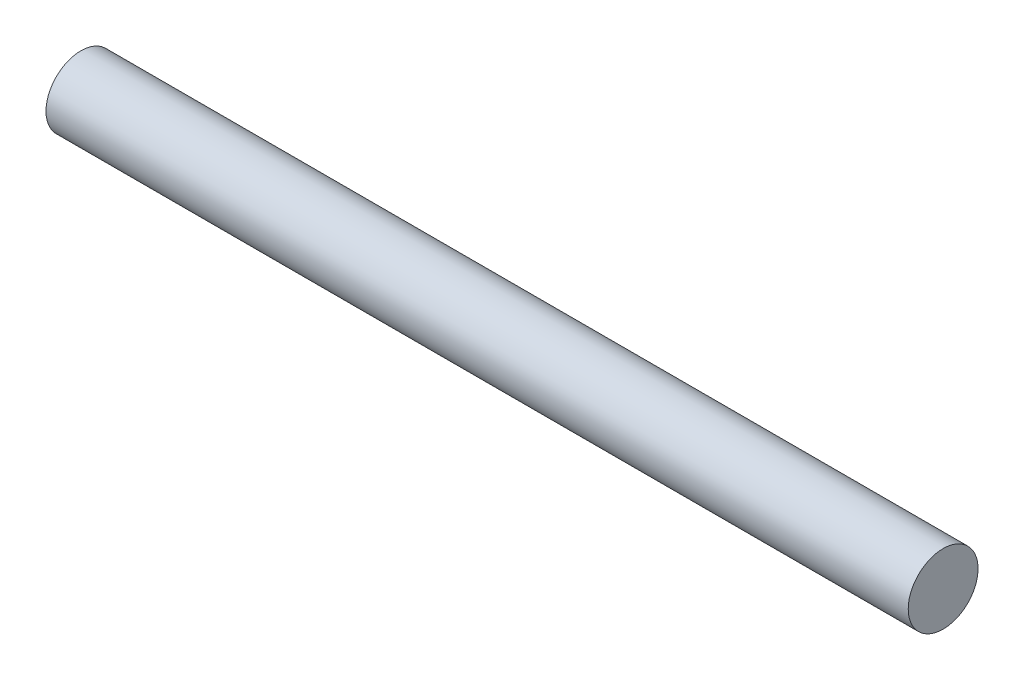
ISO-10303-21;
HEADER;
FILE_DESCRIPTION(('STEP AP214'),'2;1');
FILE_NAME('part.step','',(''),(''),'','','');
FILE_SCHEMA(('AUTOMOTIVE_DESIGN { 1 0 10303 214 1 1 1 1 }'));
ENDSEC;
DATA;
#1=APPLICATION_CONTEXT('core data for automotive mechanical design processes');
#2=APPLICATION_PROTOCOL_DEFINITION('international standard','automotive_design',2000,#1);
#3=PRODUCT_CONTEXT('',#1,'mechanical');
#4=PRODUCT('Part','Part','',(#3));
#5=PRODUCT_RELATED_PRODUCT_CATEGORY('part','',(#4));
#6=PRODUCT_DEFINITION_FORMATION('','',#4);
#7=PRODUCT_DEFINITION_CONTEXT('part definition',#1,'design');
#8=PRODUCT_DEFINITION('design','',#6,#7);
#9=PRODUCT_DEFINITION_SHAPE('','',#8);
#10=(LENGTH_UNIT() NAMED_UNIT(*) SI_UNIT(.MILLI.,.METRE.));
#11=(NAMED_UNIT(*) PLANE_ANGLE_UNIT() SI_UNIT($,.RADIAN.));
#12=(NAMED_UNIT(*) SI_UNIT($,.STERADIAN.) SOLID_ANGLE_UNIT());
#13=UNCERTAINTY_MEASURE_WITH_UNIT(LENGTH_MEASURE(1.E-05),#10,'distance_accuracy_value','');
#14=(GEOMETRIC_REPRESENTATION_CONTEXT(3) GLOBAL_UNCERTAINTY_ASSIGNED_CONTEXT((#13)) GLOBAL_UNIT_ASSIGNED_CONTEXT((#10,
#11,#12)) REPRESENTATION_CONTEXT('',''));
#15=CARTESIAN_POINT('',(0.,0.,0.));
#16=DIRECTION('',(0.,0.,1.));
#17=DIRECTION('',(1.,0.,0.));
#18=AXIS2_PLACEMENT_3D('',#15,#16,#17);
#19=CARTESIAN_POINT('',(30.861,0.,0.));
#20=DIRECTION('',(1.,0.,0.));
#21=DIRECTION('',(0.,0.,-1.));
#22=AXIS2_PLACEMENT_3D('',#19,#20,#21);
#23=PLANE('',#22);
#24=CARTESIAN_POINT('',(30.861,0.,0.));
#25=DIRECTION('',(-1.,0.,0.));
#26=DIRECTION('',(0.,0.,1.));
#27=AXIS2_PLACEMENT_3D('',#24,#25,#26);
#28=CIRCLE('',#27,2.5);
#29=CARTESIAN_POINT('',(30.861,0.,2.5));
#30=VERTEX_POINT('',#29);
#31=EDGE_CURVE('E18',#30,#30,#28,.T.);
#32=ORIENTED_EDGE('',*,*,#31,.F.);
#33=EDGE_LOOP('',(#32));
#34=FACE_BOUND('',#33,.T.);
#35=ADVANCED_FACE('F15',(#34),#23,.T.);
#36=CARTESIAN_POINT('',(-30.861,0.,0.));
#37=DIRECTION('',(1.,0.,0.));
#38=DIRECTION('',(0.,0.,-1.));
#39=AXIS2_PLACEMENT_3D('',#36,#37,#38);
#40=PLANE('',#39);
#41=CARTESIAN_POINT('',(-30.861,0.,0.));
#42=DIRECTION('',(-1.,0.,0.));
#43=DIRECTION('',(0.,0.,1.));
#44=AXIS2_PLACEMENT_3D('',#41,#42,#43);
#45=CIRCLE('',#44,2.5);
#46=CARTESIAN_POINT('',(-30.861,0.,2.5));
#47=VERTEX_POINT('',#46);
#48=EDGE_CURVE('E10',#47,#47,#45,.F.);
#49=ORIENTED_EDGE('',*,*,#48,.F.);
#50=EDGE_LOOP('',(#49));
#51=FACE_BOUND('',#50,.T.);
#52=ADVANCED_FACE('F30',(#51),#40,.F.);
#53=CARTESIAN_POINT('',(30.861,0.,0.));
#54=DIRECTION('',(-1.,0.,0.));
#55=DIRECTION('',(0.,0.,1.));
#56=AXIS2_PLACEMENT_3D('',#53,#54,#55);
#57=CYLINDRICAL_SURFACE('',#56,2.5);
#58=ORIENTED_EDGE('',*,*,#48,.T.);
#59=EDGE_LOOP('',(#58));
#60=FACE_BOUND('',#59,.T.);
#61=ORIENTED_EDGE('',*,*,#31,.T.);
#62=EDGE_LOOP('',(#61));
#63=FACE_BOUND('',#62,.T.);
#64=ADVANCED_FACE('F27',(#60,#63),#57,.T.);
#65=CLOSED_SHELL('',(#35,#52,#64));
#66=MANIFOLD_SOLID_BREP('B1',#65);
#67=ADVANCED_BREP_SHAPE_REPRESENTATION('',(#18,#66),#14);
#68=SHAPE_DEFINITION_REPRESENTATION(#9,#67);
ENDSEC;
END-ISO-10303-21;
